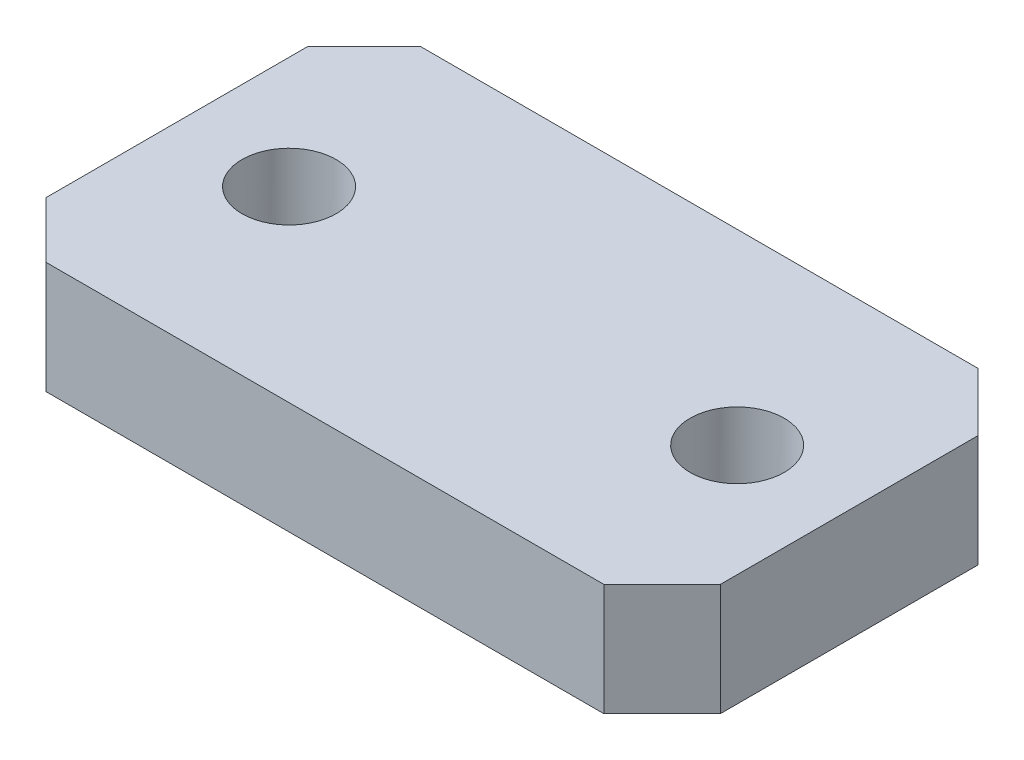
ISO-10303-21;
HEADER;
FILE_DESCRIPTION(('STEP AP214'),'2;1');
FILE_NAME('part.step','',(''),(''),'','','');
FILE_SCHEMA(('AUTOMOTIVE_DESIGN { 1 0 10303 214 1 1 1 1 }'));
ENDSEC;
DATA;
#1=APPLICATION_CONTEXT('core data for automotive mechanical design processes');
#2=APPLICATION_PROTOCOL_DEFINITION('international standard','automotive_design',2000,#1);
#3=PRODUCT_CONTEXT('',#1,'mechanical');
#4=PRODUCT('Part','Part','',(#3));
#5=PRODUCT_RELATED_PRODUCT_CATEGORY('part','',(#4));
#6=PRODUCT_DEFINITION_FORMATION('','',#4);
#7=PRODUCT_DEFINITION_CONTEXT('part definition',#1,'design');
#8=PRODUCT_DEFINITION('design','',#6,#7);
#9=PRODUCT_DEFINITION_SHAPE('','',#8);
#10=(LENGTH_UNIT() NAMED_UNIT(*) SI_UNIT(.MILLI.,.METRE.));
#11=(NAMED_UNIT(*) PLANE_ANGLE_UNIT() SI_UNIT($,.RADIAN.));
#12=(NAMED_UNIT(*) SI_UNIT($,.STERADIAN.) SOLID_ANGLE_UNIT());
#13=UNCERTAINTY_MEASURE_WITH_UNIT(LENGTH_MEASURE(1.E-05),#10,'distance_accuracy_value','');
#14=(GEOMETRIC_REPRESENTATION_CONTEXT(3) GLOBAL_UNCERTAINTY_ASSIGNED_CONTEXT((#13)) GLOBAL_UNIT_ASSIGNED_CONTEXT((#10,
#11,#12)) REPRESENTATION_CONTEXT('',''));
#15=CARTESIAN_POINT('',(0.,0.,0.));
#16=DIRECTION('',(0.,0.,1.));
#17=DIRECTION('',(1.,0.,0.));
#18=AXIS2_PLACEMENT_3D('',#15,#16,#17);
#19=CARTESIAN_POINT('',(19.05,6.35,10.6045));
#20=DIRECTION('',(-1.,0.,0.));
#21=DIRECTION('',(0.,0.,1.));
#22=AXIS2_PLACEMENT_3D('',#19,#20,#21);
#23=PLANE('',#22);
#24=DIRECTION('',(0.,0.,-1.));
#25=VECTOR('',#24,1.);
#26=CARTESIAN_POINT('',(19.05,6.35,10.6045));
#27=LINE('',#26,#25);
#28=CARTESIAN_POINT('',(19.05,6.35,7.3024999999999));
#29=VERTEX_POINT('',#28);
#30=CARTESIAN_POINT('',(19.05,6.35,-7.30250000000009));
#31=VERTEX_POINT('',#30);
#32=EDGE_CURVE('E118',#29,#31,#27,.T.);
#33=ORIENTED_EDGE('',*,*,#32,.F.);
#34=DIRECTION('',(0.,1.,0.));
#35=VECTOR('',#34,1.);
#36=CARTESIAN_POINT('',(19.05,-3.175,7.3024999999999));
#37=LINE('',#36,#35);
#38=CARTESIAN_POINT('',(19.05,0.,7.3024999999999));
#39=VERTEX_POINT('',#38);
#40=EDGE_CURVE('E155',#39,#29,#37,.T.);
#41=ORIENTED_EDGE('',*,*,#40,.F.);
#42=DIRECTION('',(0.,0.,-1.));
#43=VECTOR('',#42,1.);
#44=CARTESIAN_POINT('',(19.05,0.,10.6045));
#45=LINE('',#44,#43);
#46=CARTESIAN_POINT('',(19.05,0.,-7.30250000000008));
#47=VERTEX_POINT('',#46);
#48=EDGE_CURVE('E133',#39,#47,#45,.T.);
#49=ORIENTED_EDGE('',*,*,#48,.T.);
#50=DIRECTION('',(0.,1.,0.));
#51=VECTOR('',#50,1.);
#52=CARTESIAN_POINT('',(19.05,-3.175,-7.30250000000009));
#53=LINE('',#52,#51);
#54=EDGE_CURVE('E107',#47,#31,#53,.T.);
#55=ORIENTED_EDGE('',*,*,#54,.T.);
#56=EDGE_LOOP('',(#33,#41,#49,#55));
#57=FACE_BOUND('',#56,.T.);
#58=ADVANCED_FACE('F34',(#57),#23,.F.);
#59=CARTESIAN_POINT('',(-19.05,6.35,-10.6045));
#60=DIRECTION('',(0.,0.,1.));
#61=DIRECTION('',(1.,0.,0.));
#62=AXIS2_PLACEMENT_3D('',#59,#60,#61);
#63=PLANE('',#62);
#64=DIRECTION('',(-1.,0.,0.));
#65=VECTOR('',#64,1.);
#66=CARTESIAN_POINT('',(-19.05,6.35,-10.6045));
#67=LINE('',#66,#65);
#68=CARTESIAN_POINT('',(15.748,6.35,-10.6045));
#69=VERTEX_POINT('',#68);
#70=CARTESIAN_POINT('',(-15.875,6.35,-10.6045));
#71=VERTEX_POINT('',#70);
#72=EDGE_CURVE('E115',#69,#71,#67,.T.);
#73=ORIENTED_EDGE('',*,*,#72,.F.);
#74=DIRECTION('',(0.,1.,0.));
#75=VECTOR('',#74,1.);
#76=CARTESIAN_POINT('',(15.748,-3.175,-10.6045));
#77=LINE('',#76,#75);
#78=CARTESIAN_POINT('',(15.748,0.,-10.6045));
#79=VERTEX_POINT('',#78);
#80=EDGE_CURVE('E96',#79,#69,#77,.T.);
#81=ORIENTED_EDGE('',*,*,#80,.F.);
#82=DIRECTION('',(-1.,0.,0.));
#83=VECTOR('',#82,1.);
#84=CARTESIAN_POINT('',(-19.05,0.,-10.6045));
#85=LINE('',#84,#83);
#86=CARTESIAN_POINT('',(-15.875,0.,-10.6045));
#87=VERTEX_POINT('',#86);
#88=EDGE_CURVE('E136',#79,#87,#85,.T.);
#89=ORIENTED_EDGE('',*,*,#88,.T.);
#90=DIRECTION('',(0.,1.,0.));
#91=VECTOR('',#90,1.);
#92=CARTESIAN_POINT('',(-15.875,-3.175,-10.6045));
#93=LINE('',#92,#91);
#94=EDGE_CURVE('E48',#87,#71,#93,.T.);
#95=ORIENTED_EDGE('',*,*,#94,.T.);
#96=EDGE_LOOP('',(#73,#81,#89,#95));
#97=FACE_BOUND('',#96,.T.);
#98=ADVANCED_FACE('F121',(#97),#63,.F.);
#99=CARTESIAN_POINT('',(-19.05,6.35,10.6045));
#100=DIRECTION('',(1.,0.,0.));
#101=DIRECTION('',(0.,0.,-1.));
#102=AXIS2_PLACEMENT_3D('',#99,#100,#101);
#103=PLANE('',#102);
#104=DIRECTION('',(0.,0.,1.));
#105=VECTOR('',#104,1.);
#106=CARTESIAN_POINT('',(-19.05,0.,10.6045));
#107=LINE('',#106,#105);
#108=CARTESIAN_POINT('',(-19.05,0.,-7.42949999999993));
#109=VERTEX_POINT('',#108);
#110=CARTESIAN_POINT('',(-19.05,0.,7.42950000000005));
#111=VERTEX_POINT('',#110);
#112=EDGE_CURVE('E139',#109,#111,#107,.T.);
#113=ORIENTED_EDGE('',*,*,#112,.T.);
#114=DIRECTION('',(0.,1.,0.));
#115=VECTOR('',#114,1.);
#116=CARTESIAN_POINT('',(-19.05,-3.175,7.42950000000005));
#117=LINE('',#116,#115);
#118=CARTESIAN_POINT('',(-19.05,6.35,7.42950000000005));
#119=VERTEX_POINT('',#118);
#120=EDGE_CURVE('E55',#111,#119,#117,.T.);
#121=ORIENTED_EDGE('',*,*,#120,.T.);
#122=DIRECTION('',(0.,0.,1.));
#123=VECTOR('',#122,1.);
#124=CARTESIAN_POINT('',(-19.05,6.35,10.6045));
#125=LINE('',#124,#123);
#126=CARTESIAN_POINT('',(-19.05,6.35,-7.42949999999993));
#127=VERTEX_POINT('',#126);
#128=EDGE_CURVE('E122',#127,#119,#125,.T.);
#129=ORIENTED_EDGE('',*,*,#128,.F.);
#130=DIRECTION('',(0.,1.,0.));
#131=VECTOR('',#130,1.);
#132=CARTESIAN_POINT('',(-19.05,-3.175,-7.42949999999993));
#133=LINE('',#132,#131);
#134=EDGE_CURVE('E168',#109,#127,#133,.T.);
#135=ORIENTED_EDGE('',*,*,#134,.F.);
#136=EDGE_LOOP('',(#113,#121,#129,#135));
#137=FACE_BOUND('',#136,.T.);
#138=ADVANCED_FACE('F171',(#137),#103,.F.);
#139=CARTESIAN_POINT('',(-19.05,6.35,10.6045));
#140=DIRECTION('',(0.,0.,-1.));
#141=DIRECTION('',(-1.,0.,0.));
#142=AXIS2_PLACEMENT_3D('',#139,#140,#141);
#143=PLANE('',#142);
#144=DIRECTION('',(1.,0.,0.));
#145=VECTOR('',#144,1.);
#146=CARTESIAN_POINT('',(-19.05,6.35,10.6045));
#147=LINE('',#146,#145);
#148=CARTESIAN_POINT('',(-15.875,6.35,10.6045));
#149=VERTEX_POINT('',#148);
#150=CARTESIAN_POINT('',(15.748,6.35,10.6045));
#151=VERTEX_POINT('',#150);
#152=EDGE_CURVE('E124',#149,#151,#147,.T.);
#153=ORIENTED_EDGE('',*,*,#152,.F.);
#154=DIRECTION('',(0.,1.,0.));
#155=VECTOR('',#154,1.);
#156=CARTESIAN_POINT('',(-15.875,-3.175,10.6045));
#157=LINE('',#156,#155);
#158=CARTESIAN_POINT('',(-15.875,0.,10.6045));
#159=VERTEX_POINT('',#158);
#160=EDGE_CURVE('E291',#159,#149,#157,.T.);
#161=ORIENTED_EDGE('',*,*,#160,.F.);
#162=DIRECTION('',(1.,0.,0.));
#163=VECTOR('',#162,1.);
#164=CARTESIAN_POINT('',(-19.05,0.,10.6045));
#165=LINE('',#164,#163);
#166=CARTESIAN_POINT('',(15.748,0.,10.6045));
#167=VERTEX_POINT('',#166);
#168=EDGE_CURVE('E126',#159,#167,#165,.T.);
#169=ORIENTED_EDGE('',*,*,#168,.T.);
#170=DIRECTION('',(0.,1.,0.));
#171=VECTOR('',#170,1.);
#172=CARTESIAN_POINT('',(15.748,-3.175,10.6045));
#173=LINE('',#172,#171);
#174=EDGE_CURVE('E119',#167,#151,#173,.T.);
#175=ORIENTED_EDGE('',*,*,#174,.T.);
#176=EDGE_LOOP('',(#153,#161,#169,#175));
#177=FACE_BOUND('',#176,.T.);
#178=ADVANCED_FACE('F185',(#177),#143,.F.);
#179=CARTESIAN_POINT('',(0.,6.35,0.));
#180=DIRECTION('',(0.,-1.,0.));
#181=DIRECTION('',(0.,0.,-1.));
#182=AXIS2_PLACEMENT_3D('',#179,#180,#181);
#183=PLANE('',#182);
#184=CARTESIAN_POINT('',(-12.7,6.35,0.));
#185=DIRECTION('',(0.,1.,0.));
#186=DIRECTION('',(0.,0.,1.));
#187=AXIS2_PLACEMENT_3D('',#184,#185,#186);
#188=CIRCLE('',#187,2.667);
#189=CARTESIAN_POINT('',(-12.7,6.35,2.66699999999999));
#190=VERTEX_POINT('',#189);
#191=EDGE_CURVE('E147',#190,#190,#188,.T.);
#192=ORIENTED_EDGE('',*,*,#191,.F.);
#193=EDGE_LOOP('',(#192));
#194=FACE_BOUND('',#193,.T.);
#195=CARTESIAN_POINT('',(12.7,6.35,0.));
#196=DIRECTION('',(0.,1.,0.));
#197=DIRECTION('',(0.,0.,1.));
#198=AXIS2_PLACEMENT_3D('',#195,#196,#197);
#199=CIRCLE('',#198,2.667);
#200=CARTESIAN_POINT('',(12.7,6.35,2.66699999999999));
#201=VERTEX_POINT('',#200);
#202=EDGE_CURVE('E174',#201,#201,#199,.T.);
#203=ORIENTED_EDGE('',*,*,#202,.F.);
#204=EDGE_LOOP('',(#203));
#205=FACE_BOUND('',#204,.T.);
#206=ORIENTED_EDGE('',*,*,#128,.T.);
#207=DIRECTION('',(-0.707106781186556,0.,-0.707106781186539));
#208=VECTOR('',#207,1.);
#209=CARTESIAN_POINT('',(-15.875,6.35,10.6045));
#210=LINE('',#209,#208);
#211=EDGE_CURVE('E294',#149,#119,#210,.T.);
#212=ORIENTED_EDGE('',*,*,#211,.F.);
#213=ORIENTED_EDGE('',*,*,#152,.T.);
#214=DIRECTION('',(-0.707106781186539,0.,0.707106781186556));
#215=VECTOR('',#214,1.);
#216=CARTESIAN_POINT('',(15.748,6.35,10.6045));
#217=LINE('',#216,#215);
#218=EDGE_CURVE('E161',#29,#151,#217,.T.);
#219=ORIENTED_EDGE('',*,*,#218,.F.);
#220=ORIENTED_EDGE('',*,*,#32,.T.);
#221=DIRECTION('',(0.707106781186556,0.,0.707106781186539));
#222=VECTOR('',#221,1.);
#223=CARTESIAN_POINT('',(15.748,6.35,-10.6045));
#224=LINE('',#223,#222);
#225=EDGE_CURVE('E99',#69,#31,#224,.T.);
#226=ORIENTED_EDGE('',*,*,#225,.F.);
#227=ORIENTED_EDGE('',*,*,#72,.T.);
#228=DIRECTION('',(0.707106781186541,0.,-0.707106781186554));
#229=VECTOR('',#228,1.);
#230=CARTESIAN_POINT('',(-15.875,6.35,-10.6045));
#231=LINE('',#230,#229);
#232=EDGE_CURVE('E172',#127,#71,#231,.T.);
#233=ORIENTED_EDGE('',*,*,#232,.F.);
#234=EDGE_LOOP('',(#206,#212,#213,#219,#220,#226,#227,#233));
#235=FACE_BOUND('',#234,.T.);
#236=ADVANCED_FACE('F113',(#194,#205,#235),#183,.F.);
#237=CARTESIAN_POINT('',(0.,0.,0.));
#238=DIRECTION('',(0.,-1.,0.));
#239=DIRECTION('',(0.,0.,-1.));
#240=AXIS2_PLACEMENT_3D('',#237,#238,#239);
#241=PLANE('',#240);
#242=DIRECTION('',(0.707106781186556,0.,0.707106781186539));
#243=VECTOR('',#242,1.);
#244=CARTESIAN_POINT('',(-13.2397499999998,0.,13.2397500000001));
#245=LINE('',#244,#243);
#246=EDGE_CURVE('E11',#111,#159,#245,.T.);
#247=ORIENTED_EDGE('',*,*,#246,.F.);
#248=ORIENTED_EDGE('',*,*,#112,.F.);
#249=DIRECTION('',(-0.707106781186541,0.,0.707106781186554));
#250=VECTOR('',#249,1.);
#251=CARTESIAN_POINT('',(-13.2397500000001,0.,-13.2397499999999));
#252=LINE('',#251,#250);
#253=EDGE_CURVE('E132',#87,#109,#252,.T.);
#254=ORIENTED_EDGE('',*,*,#253,.F.);
#255=ORIENTED_EDGE('',*,*,#88,.F.);
#256=DIRECTION('',(-0.707106781186556,0.,-0.707106781186539));
#257=VECTOR('',#256,1.);
#258=CARTESIAN_POINT('',(13.1762499999998,0.,-13.1762500000001));
#259=LINE('',#258,#257);
#260=EDGE_CURVE('E102',#47,#79,#259,.T.);
#261=ORIENTED_EDGE('',*,*,#260,.F.);
#262=ORIENTED_EDGE('',*,*,#48,.F.);
#263=DIRECTION('',(0.707106781186539,0.,-0.707106781186556));
#264=VECTOR('',#263,1.);
#265=CARTESIAN_POINT('',(13.1762500000002,0.,13.1762499999999));
#266=LINE('',#265,#264);
#267=EDGE_CURVE('E41',#167,#39,#266,.T.);
#268=ORIENTED_EDGE('',*,*,#267,.F.);
#269=ORIENTED_EDGE('',*,*,#168,.F.);
#270=EDGE_LOOP('',(#247,#248,#254,#255,#261,#262,#268,#269));
#271=FACE_BOUND('',#270,.T.);
#272=CARTESIAN_POINT('',(-12.7,0.,0.));
#273=DIRECTION('',(0.,-1.,0.));
#274=DIRECTION('',(0.,0.,-1.));
#275=AXIS2_PLACEMENT_3D('',#272,#273,#274);
#276=CIRCLE('',#275,2.667);
#277=CARTESIAN_POINT('',(-12.7,0.,-2.66700000000001));
#278=VERTEX_POINT('',#277);
#279=EDGE_CURVE('E137',#278,#278,#276,.T.);
#280=ORIENTED_EDGE('',*,*,#279,.F.);
#281=EDGE_LOOP('',(#280));
#282=FACE_BOUND('',#281,.T.);
#283=CARTESIAN_POINT('',(12.7,0.,0.));
#284=DIRECTION('',(0.,-1.,0.));
#285=DIRECTION('',(0.,0.,-1.));
#286=AXIS2_PLACEMENT_3D('',#283,#284,#285);
#287=CIRCLE('',#286,2.667);
#288=CARTESIAN_POINT('',(12.7,0.,-2.66700000000001));
#289=VERTEX_POINT('',#288);
#290=EDGE_CURVE('E144',#289,#289,#287,.T.);
#291=ORIENTED_EDGE('',*,*,#290,.F.);
#292=EDGE_LOOP('',(#291));
#293=FACE_BOUND('',#292,.T.);
#294=ADVANCED_FACE('F163',(#271,#282,#293),#241,.T.);
#295=CARTESIAN_POINT('',(12.7,-3.175,0.));
#296=DIRECTION('',(0.,1.,0.));
#297=DIRECTION('',(0.,0.,1.));
#298=AXIS2_PLACEMENT_3D('',#295,#296,#297);
#299=CYLINDRICAL_SURFACE('',#298,2.667);
#300=ORIENTED_EDGE('',*,*,#290,.T.);
#301=EDGE_LOOP('',(#300));
#302=FACE_BOUND('',#301,.T.);
#303=ORIENTED_EDGE('',*,*,#202,.T.);
#304=EDGE_LOOP('',(#303));
#305=FACE_BOUND('',#304,.T.);
#306=ADVANCED_FACE('F182',(#302,#305),#299,.F.);
#307=CARTESIAN_POINT('',(-12.7,-3.175,0.));
#308=DIRECTION('',(0.,1.,0.));
#309=DIRECTION('',(0.,0.,1.));
#310=AXIS2_PLACEMENT_3D('',#307,#308,#309);
#311=CYLINDRICAL_SURFACE('',#310,2.667);
#312=ORIENTED_EDGE('',*,*,#279,.T.);
#313=EDGE_LOOP('',(#312));
#314=FACE_BOUND('',#313,.T.);
#315=ORIENTED_EDGE('',*,*,#191,.T.);
#316=EDGE_LOOP('',(#315));
#317=FACE_BOUND('',#316,.T.);
#318=ADVANCED_FACE('F232',(#314,#317),#311,.F.);
#319=CARTESIAN_POINT('',(-15.875,-3.175,-10.6045));
#320=DIRECTION('',(0.707106781186554,0.,0.707106781186541));
#321=DIRECTION('',(0.707106781186541,0.,-0.707106781186554));
#322=AXIS2_PLACEMENT_3D('',#319,#320,#321);
#323=PLANE('',#322);
#324=ORIENTED_EDGE('',*,*,#253,.T.);
#325=ORIENTED_EDGE('',*,*,#134,.T.);
#326=ORIENTED_EDGE('',*,*,#232,.T.);
#327=ORIENTED_EDGE('',*,*,#94,.F.);
#328=EDGE_LOOP('',(#324,#325,#326,#327));
#329=FACE_BOUND('',#328,.T.);
#330=ADVANCED_FACE('F167',(#329),#323,.F.);
#331=CARTESIAN_POINT('',(15.748,-3.175,-10.6045));
#332=DIRECTION('',(-0.707106781186539,0.,0.707106781186556));
#333=DIRECTION('',(0.707106781186556,0.,0.707106781186539));
#334=AXIS2_PLACEMENT_3D('',#331,#332,#333);
#335=PLANE('',#334);
#336=ORIENTED_EDGE('',*,*,#260,.T.);
#337=ORIENTED_EDGE('',*,*,#80,.T.);
#338=ORIENTED_EDGE('',*,*,#225,.T.);
#339=ORIENTED_EDGE('',*,*,#54,.F.);
#340=EDGE_LOOP('',(#336,#337,#338,#339));
#341=FACE_BOUND('',#340,.T.);
#342=ADVANCED_FACE('F98',(#341),#335,.F.);
#343=CARTESIAN_POINT('',(15.748,-3.175,10.6045));
#344=DIRECTION('',(-0.707106781186556,0.,-0.707106781186539));
#345=DIRECTION('',(-0.707106781186539,0.,0.707106781186556));
#346=AXIS2_PLACEMENT_3D('',#343,#344,#345);
#347=PLANE('',#346);
#348=ORIENTED_EDGE('',*,*,#267,.T.);
#349=ORIENTED_EDGE('',*,*,#40,.T.);
#350=ORIENTED_EDGE('',*,*,#218,.T.);
#351=ORIENTED_EDGE('',*,*,#174,.F.);
#352=EDGE_LOOP('',(#348,#349,#350,#351));
#353=FACE_BOUND('',#352,.T.);
#354=ADVANCED_FACE('F154',(#353),#347,.F.);
#355=CARTESIAN_POINT('',(-15.875,-3.175,10.6045));
#356=DIRECTION('',(0.707106781186539,0.,-0.707106781186556));
#357=DIRECTION('',(-0.707106781186556,0.,-0.707106781186539));
#358=AXIS2_PLACEMENT_3D('',#355,#356,#357);
#359=PLANE('',#358);
#360=ORIENTED_EDGE('',*,*,#246,.T.);
#361=ORIENTED_EDGE('',*,*,#160,.T.);
#362=ORIENTED_EDGE('',*,*,#211,.T.);
#363=ORIENTED_EDGE('',*,*,#120,.F.);
#364=EDGE_LOOP('',(#360,#361,#362,#363));
#365=FACE_BOUND('',#364,.T.);
#366=ADVANCED_FACE('F251',(#365),#359,.F.);
#367=CLOSED_SHELL('',(#58,#98,#138,#178,#236,#294,#306,#318,#330,#342,#354,#366));
#368=MANIFOLD_SOLID_BREP('B2',#367);
#369=ADVANCED_BREP_SHAPE_REPRESENTATION('',(#18,#368),#14);
#370=SHAPE_DEFINITION_REPRESENTATION(#9,#369);
ENDSEC;
END-ISO-10303-21;
